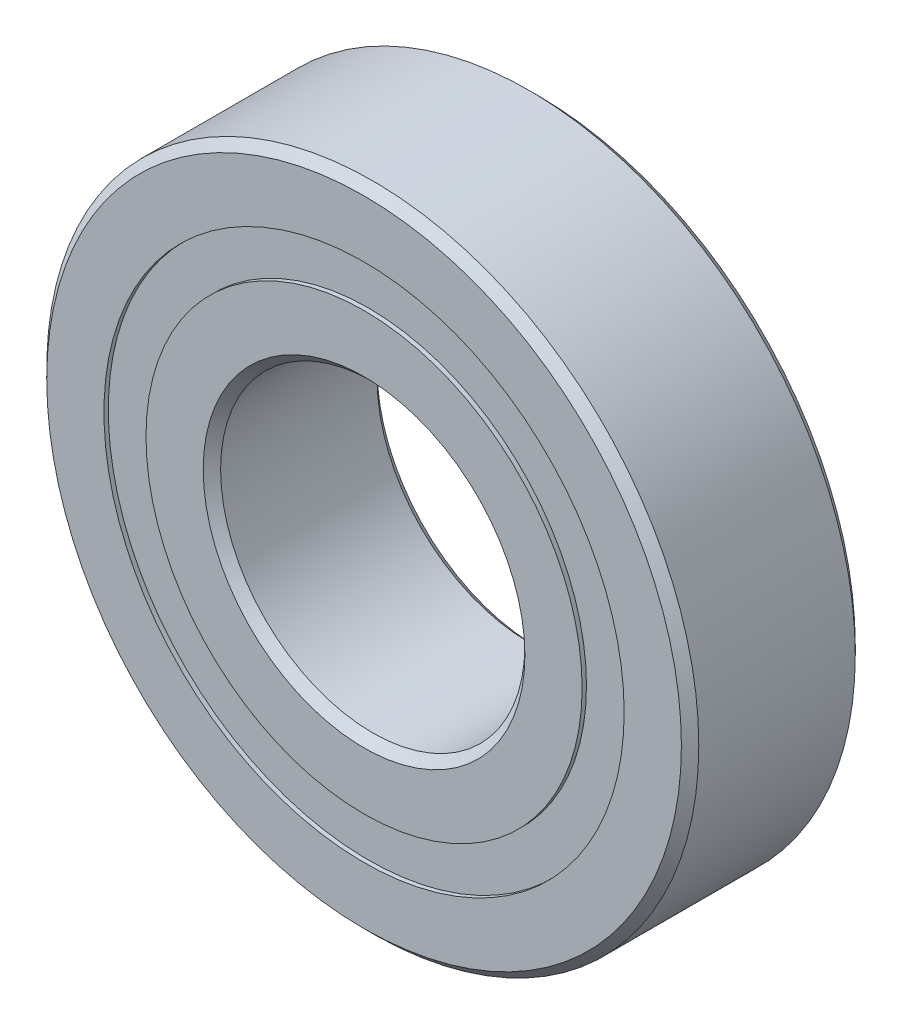
ISO-10303-21;
HEADER;
FILE_DESCRIPTION(('STEP AP214'),'2;1');
FILE_NAME('part.step','',(''),(''),'','','');
FILE_SCHEMA(('AUTOMOTIVE_DESIGN { 1 0 10303 214 1 1 1 1 }'));
ENDSEC;
DATA;
#1=APPLICATION_CONTEXT('core data for automotive mechanical design processes');
#2=APPLICATION_PROTOCOL_DEFINITION('international standard','automotive_design',2000,#1);
#3=PRODUCT_CONTEXT('',#1,'mechanical');
#4=PRODUCT('Part','Part','',(#3));
#5=PRODUCT_RELATED_PRODUCT_CATEGORY('part','',(#4));
#6=PRODUCT_DEFINITION_FORMATION('','',#4);
#7=PRODUCT_DEFINITION_CONTEXT('part definition',#1,'design');
#8=PRODUCT_DEFINITION('design','',#6,#7);
#9=PRODUCT_DEFINITION_SHAPE('','',#8);
#10=(LENGTH_UNIT() NAMED_UNIT(*) SI_UNIT(.MILLI.,.METRE.));
#11=(NAMED_UNIT(*) PLANE_ANGLE_UNIT() SI_UNIT($,.RADIAN.));
#12=(NAMED_UNIT(*) SI_UNIT($,.STERADIAN.) SOLID_ANGLE_UNIT());
#13=UNCERTAINTY_MEASURE_WITH_UNIT(LENGTH_MEASURE(1.E-05),#10,'distance_accuracy_value','');
#14=(GEOMETRIC_REPRESENTATION_CONTEXT(3) GLOBAL_UNCERTAINTY_ASSIGNED_CONTEXT((#13)) GLOBAL_UNIT_ASSIGNED_CONTEXT((#10,
#11,#12)) REPRESENTATION_CONTEXT('',''));
#15=CARTESIAN_POINT('',(0.,0.,0.));
#16=DIRECTION('',(0.,0.,1.));
#17=DIRECTION('',(1.,0.,0.));
#18=AXIS2_PLACEMENT_3D('',#15,#16,#17);
#19=CARTESIAN_POINT('',(0.,18.9976648351648,-6.0325));
#20=DIRECTION('',(0.,0.,1.));
#21=DIRECTION('',(1.,0.,0.));
#22=AXIS2_PLACEMENT_3D('',#19,#20,#21);
#23=PLANE('',#22);
#24=CARTESIAN_POINT('',(0.,0.,-6.0325));
#25=DIRECTION('',(0.,0.,1.));
#26=DIRECTION('',(1.,0.,0.));
#27=AXIS2_PLACEMENT_3D('',#24,#25,#26);
#28=CIRCLE('',#27,18.9976648351648);
#29=CARTESIAN_POINT('',(18.9976648351648,0.,-6.0325));
#30=VERTEX_POINT('',#29);
#31=EDGE_CURVE('E55',#30,#30,#28,.T.);
#32=ORIENTED_EDGE('',*,*,#31,.F.);
#33=EDGE_LOOP('',(#32));
#34=FACE_BOUND('',#33,.T.);
#35=CARTESIAN_POINT('',(0.,0.,-6.0325));
#36=DIRECTION('',(0.,0.,1.));
#37=DIRECTION('',(1.,0.,0.));
#38=AXIS2_PLACEMENT_3D('',#35,#36,#37);
#39=CIRCLE('',#38,15.9273351648352);
#40=CARTESIAN_POINT('',(15.9273351648352,0.,-6.0325));
#41=VERTEX_POINT('',#40);
#42=EDGE_CURVE('E11',#41,#41,#39,.T.);
#43=ORIENTED_EDGE('',*,*,#42,.T.);
#44=EDGE_LOOP('',(#43));
#45=FACE_BOUND('',#44,.T.);
#46=ADVANCED_FACE('F41',(#34,#45),#23,.F.);
#47=CARTESIAN_POINT('',(0.,0.,6.35));
#48=DIRECTION('',(0.,0.,1.));
#49=DIRECTION('',(1.,0.,0.));
#50=AXIS2_PLACEMENT_3D('',#47,#48,#49);
#51=CYLINDRICAL_SURFACE('',#50,15.9273351648352);
#52=ORIENTED_EDGE('',*,*,#42,.F.);
#53=EDGE_LOOP('',(#52));
#54=FACE_BOUND('',#53,.T.);
#55=CARTESIAN_POINT('',(0.,0.,-3.21273549218289));
#56=DIRECTION('',(0.,0.,1.));
#57=DIRECTION('',(1.,0.,0.));
#58=AXIS2_PLACEMENT_3D('',#55,#56,#57);
#59=CIRCLE('',#58,15.9273351648352);
#60=CARTESIAN_POINT('',(15.9273351648352,0.,-3.21273549218289));
#61=VERTEX_POINT('',#60);
#62=EDGE_CURVE('E47',#61,#61,#59,.T.);
#63=ORIENTED_EDGE('',*,*,#62,.T.);
#64=EDGE_LOOP('',(#63));
#65=FACE_BOUND('',#64,.T.);
#66=ADVANCED_FACE('F64',(#54,#65),#51,.F.);
#67=CARTESIAN_POINT('',(0.,18.9976648351648,-3.21273549218289));
#68=DIRECTION('',(0.,0.,-1.));
#69=DIRECTION('',(-1.,0.,0.));
#70=AXIS2_PLACEMENT_3D('',#67,#68,#69);
#71=PLANE('',#70);
#72=ORIENTED_EDGE('',*,*,#62,.F.);
#73=EDGE_LOOP('',(#72));
#74=FACE_BOUND('',#73,.T.);
#75=CARTESIAN_POINT('',(0.,0.,-3.21273549218288));
#76=DIRECTION('',(0.,0.,1.));
#77=DIRECTION('',(1.,0.,0.));
#78=AXIS2_PLACEMENT_3D('',#75,#76,#77);
#79=CIRCLE('',#78,18.9976648351648);
#80=CARTESIAN_POINT('',(18.9976648351648,0.,-3.21273549218288));
#81=VERTEX_POINT('',#80);
#82=EDGE_CURVE('E51',#81,#81,#79,.T.);
#83=ORIENTED_EDGE('',*,*,#82,.T.);
#84=EDGE_LOOP('',(#83));
#85=FACE_BOUND('',#84,.T.);
#86=ADVANCED_FACE('F68',(#74,#85),#71,.F.);
#87=CARTESIAN_POINT('',(0.,0.,6.35));
#88=DIRECTION('',(0.,0.,1.));
#89=DIRECTION('',(1.,0.,0.));
#90=AXIS2_PLACEMENT_3D('',#87,#88,#89);
#91=CYLINDRICAL_SURFACE('',#90,18.9976648351648);
#92=ORIENTED_EDGE('',*,*,#82,.F.);
#93=EDGE_LOOP('',(#92));
#94=FACE_BOUND('',#93,.T.);
#95=ORIENTED_EDGE('',*,*,#31,.T.);
#96=EDGE_LOOP('',(#95));
#97=FACE_BOUND('',#96,.T.);
#98=ADVANCED_FACE('F61',(#94,#97),#91,.T.);
#99=CLOSED_SHELL('',(#46,#66,#86,#98));
#100=MANIFOLD_SOLID_BREP('B2',#99);
#101=CARTESIAN_POINT('',(0.,18.9976648351648,6.0325));
#102=DIRECTION('',(0.,0.,-1.));
#103=DIRECTION('',(-1.,0.,0.));
#104=AXIS2_PLACEMENT_3D('',#101,#102,#103);
#105=PLANE('',#104);
#106=CARTESIAN_POINT('',(0.,0.,6.0325));
#107=DIRECTION('',(0.,0.,1.));
#108=DIRECTION('',(1.,0.,0.));
#109=AXIS2_PLACEMENT_3D('',#106,#107,#108);
#110=CIRCLE('',#109,15.9273351648352);
#111=CARTESIAN_POINT('',(15.9273351648352,0.,6.0325));
#112=VERTEX_POINT('',#111);
#113=EDGE_CURVE('E40',#112,#112,#110,.T.);
#114=ORIENTED_EDGE('',*,*,#113,.F.);
#115=EDGE_LOOP('',(#114));
#116=FACE_BOUND('',#115,.T.);
#117=CARTESIAN_POINT('',(0.,0.,6.0325));
#118=DIRECTION('',(0.,0.,1.));
#119=DIRECTION('',(1.,0.,0.));
#120=AXIS2_PLACEMENT_3D('',#117,#118,#119);
#121=CIRCLE('',#120,18.9976648351648);
#122=CARTESIAN_POINT('',(18.9976648351648,0.,6.0325));
#123=VERTEX_POINT('',#122);
#124=EDGE_CURVE('E122',#123,#123,#121,.T.);
#125=ORIENTED_EDGE('',*,*,#124,.T.);
#126=EDGE_LOOP('',(#125));
#127=FACE_BOUND('',#126,.T.);
#128=ADVANCED_FACE('F108',(#116,#127),#105,.F.);
#129=CARTESIAN_POINT('',(0.,0.,6.35));
#130=DIRECTION('',(0.,0.,1.));
#131=DIRECTION('',(1.,0.,0.));
#132=AXIS2_PLACEMENT_3D('',#129,#130,#131);
#133=CYLINDRICAL_SURFACE('',#132,15.9273351648352);
#134=CARTESIAN_POINT('',(0.,0.,3.21273549218288));
#135=DIRECTION('',(0.,0.,1.));
#136=DIRECTION('',(1.,0.,0.));
#137=AXIS2_PLACEMENT_3D('',#134,#135,#136);
#138=CIRCLE('',#137,15.9273351648352);
#139=CARTESIAN_POINT('',(15.9273351648352,0.,3.21273549218288));
#140=VERTEX_POINT('',#139);
#141=EDGE_CURVE('E114',#140,#140,#138,.T.);
#142=ORIENTED_EDGE('',*,*,#141,.F.);
#143=EDGE_LOOP('',(#142));
#144=FACE_BOUND('',#143,.T.);
#145=ORIENTED_EDGE('',*,*,#113,.T.);
#146=EDGE_LOOP('',(#145));
#147=FACE_BOUND('',#146,.T.);
#148=ADVANCED_FACE('F137',(#144,#147),#133,.F.);
#149=CARTESIAN_POINT('',(0.,18.9976648351648,3.21273549218288));
#150=DIRECTION('',(0.,0.,1.));
#151=DIRECTION('',(1.,0.,0.));
#152=AXIS2_PLACEMENT_3D('',#149,#150,#151);
#153=PLANE('',#152);
#154=CARTESIAN_POINT('',(0.,0.,3.21273549218289));
#155=DIRECTION('',(0.,0.,1.));
#156=DIRECTION('',(1.,0.,0.));
#157=AXIS2_PLACEMENT_3D('',#154,#155,#156);
#158=CIRCLE('',#157,18.9976648351648);
#159=CARTESIAN_POINT('',(18.9976648351648,0.,3.21273549218289));
#160=VERTEX_POINT('',#159);
#161=EDGE_CURVE('E118',#160,#160,#158,.T.);
#162=ORIENTED_EDGE('',*,*,#161,.F.);
#163=EDGE_LOOP('',(#162));
#164=FACE_BOUND('',#163,.T.);
#165=ORIENTED_EDGE('',*,*,#141,.T.);
#166=EDGE_LOOP('',(#165));
#167=FACE_BOUND('',#166,.T.);
#168=ADVANCED_FACE('F132',(#164,#167),#153,.F.);
#169=CARTESIAN_POINT('',(0.,0.,6.35));
#170=DIRECTION('',(0.,0.,1.));
#171=DIRECTION('',(1.,0.,0.));
#172=AXIS2_PLACEMENT_3D('',#169,#170,#171);
#173=CYLINDRICAL_SURFACE('',#172,18.9976648351648);
#174=ORIENTED_EDGE('',*,*,#124,.F.);
#175=EDGE_LOOP('',(#174));
#176=FACE_BOUND('',#175,.T.);
#177=ORIENTED_EDGE('',*,*,#161,.T.);
#178=EDGE_LOOP('',(#177));
#179=FACE_BOUND('',#178,.T.);
#180=ADVANCED_FACE('F129',(#176,#179),#173,.T.);
#181=CLOSED_SHELL('',(#128,#148,#168,#180));
#182=MANIFOLD_SOLID_BREP('B6',#181);
#183=CARTESIAN_POINT('',(-8.73124999999981,15.1229686135859,0.));
#184=DIRECTION('',(0.,0.,1.));
#185=DIRECTION('',(-0.499999999999989,0.866025403784445,0.));
#186=AXIS2_PLACEMENT_3D('',#183,#184,#185);
#187=SPHERICAL_SURFACE('',#186,3.21273549218289);
#188=CARTESIAN_POINT('',(-8.73124999999981,15.1229686135859,3.21273549218288));
#189=VERTEX_POINT('',#188);
#190=VERTEX_LOOP('',#189);
#191=FACE_BOUND('',#190,.T.);
#192=ADVANCED_FACE('F175',(#191),#187,.T.);
#193=CLOSED_SHELL('',(#192));
#194=MANIFOLD_SOLID_BREP('B35',#193);
#195=CARTESIAN_POINT('',(-15.1229686135857,8.73125000000018,0.));
#196=DIRECTION('',(0.,0.,1.));
#197=DIRECTION('',(-0.866025403784433,0.50000000000001,0.));
#198=AXIS2_PLACEMENT_3D('',#195,#196,#197);
#199=SPHERICAL_SURFACE('',#198,3.21273549218289);
#200=CARTESIAN_POINT('',(-15.1229686135857,8.73125000000018,3.21273549218288));
#201=VERTEX_POINT('',#200);
#202=VERTEX_LOOP('',#201);
#203=FACE_BOUND('',#202,.T.);
#204=ADVANCED_FACE('F195',(#203),#199,.T.);
#205=CLOSED_SHELL('',(#204));
#206=MANIFOLD_SOLID_BREP('B104',#205);
#207=CARTESIAN_POINT('',(-17.4625,1.82909978638645E-13,0.));
#208=DIRECTION('',(0.,0.,1.));
#209=DIRECTION('',(-1.,0.,0.));
#210=AXIS2_PLACEMENT_3D('',#207,#208,#209);
#211=SPHERICAL_SURFACE('',#210,3.21273549218289);
#212=CARTESIAN_POINT('',(-17.4625,1.82909978638645E-13,3.21273549218288));
#213=VERTEX_POINT('',#212);
#214=VERTEX_LOOP('',#213);
#215=FACE_BOUND('',#214,.T.);
#216=ADVANCED_FACE('F215',(#215),#211,.T.);
#217=CLOSED_SHELL('',(#216));
#218=MANIFOLD_SOLID_BREP('B171',#217);
#219=CARTESIAN_POINT('',(-15.1229686135858,-8.73124999999986,0.));
#220=DIRECTION('',(0.,0.,1.));
#221=DIRECTION('',(-0.866025403784443,-0.499999999999992,0.));
#222=AXIS2_PLACEMENT_3D('',#219,#220,#221);
#223=SPHERICAL_SURFACE('',#222,3.21273549218289);
#224=CARTESIAN_POINT('',(-15.1229686135858,-8.73124999999986,3.21273549218288));
#225=VERTEX_POINT('',#224);
#226=VERTEX_LOOP('',#225);
#227=FACE_BOUND('',#226,.T.);
#228=ADVANCED_FACE('F235',(#227),#223,.T.);
#229=CLOSED_SHELL('',(#228));
#230=MANIFOLD_SOLID_BREP('B191',#229);
#231=CARTESIAN_POINT('',(-8.73125000000012,-15.1229686135857,0.));
#232=DIRECTION('',(0.,0.,1.));
#233=DIRECTION('',(-0.500000000000007,-0.866025403784435,0.));
#234=AXIS2_PLACEMENT_3D('',#231,#232,#233);
#235=SPHERICAL_SURFACE('',#234,3.21273549218289);
#236=CARTESIAN_POINT('',(-8.73125000000012,-15.1229686135857,3.21273549218288));
#237=VERTEX_POINT('',#236);
#238=VERTEX_LOOP('',#237);
#239=FACE_BOUND('',#238,.T.);
#240=ADVANCED_FACE('F255',(#239),#235,.T.);
#241=CLOSED_SHELL('',(#240));
#242=MANIFOLD_SOLID_BREP('B211',#241);
#243=CARTESIAN_POINT('',(-1.21939985759096E-13,-17.4625,0.));
#244=DIRECTION('',(0.,0.,1.));
#245=DIRECTION('',(0.,-1.,0.));
#246=AXIS2_PLACEMENT_3D('',#243,#244,#245);
#247=SPHERICAL_SURFACE('',#246,3.21273549218289);
#248=CARTESIAN_POINT('',(-1.21939985759096E-13,-17.4625,3.21273549218288));
#249=VERTEX_POINT('',#248);
#250=VERTEX_LOOP('',#249);
#251=FACE_BOUND('',#250,.T.);
#252=ADVANCED_FACE('F275',(#251),#247,.T.);
#253=CLOSED_SHELL('',(#252));
#254=MANIFOLD_SOLID_BREP('B231',#253);
#255=CARTESIAN_POINT('',(8.73124999999991,-15.1229686135858,0.));
#256=DIRECTION('',(0.,0.,1.));
#257=DIRECTION('',(0.499999999999995,-0.866025403784442,0.));
#258=AXIS2_PLACEMENT_3D('',#255,#256,#257);
#259=SPHERICAL_SURFACE('',#258,3.21273549218289);
#260=CARTESIAN_POINT('',(8.73124999999991,-15.1229686135858,3.21273549218288));
#261=VERTEX_POINT('',#260);
#262=VERTEX_LOOP('',#261);
#263=FACE_BOUND('',#262,.T.);
#264=ADVANCED_FACE('F295',(#263),#259,.T.);
#265=CLOSED_SHELL('',(#264));
#266=MANIFOLD_SOLID_BREP('B251',#265);
#267=CARTESIAN_POINT('',(15.1229686135857,-8.73125000000007,0.));
#268=DIRECTION('',(0.,0.,1.));
#269=DIRECTION('',(0.866025403784436,-0.500000000000004,0.));
#270=AXIS2_PLACEMENT_3D('',#267,#268,#269);
#271=SPHERICAL_SURFACE('',#270,3.21273549218289);
#272=CARTESIAN_POINT('',(15.1229686135857,-8.73125000000007,3.21273549218288));
#273=VERTEX_POINT('',#272);
#274=VERTEX_LOOP('',#273);
#275=FACE_BOUND('',#274,.T.);
#276=ADVANCED_FACE('F315',(#275),#271,.T.);
#277=CLOSED_SHELL('',(#276));
#278=MANIFOLD_SOLID_BREP('B271',#277);
#279=CARTESIAN_POINT('',(17.4625,0.,0.));
#280=DIRECTION('',(0.,0.,1.));
#281=DIRECTION('',(1.,0.,0.));
#282=AXIS2_PLACEMENT_3D('',#279,#280,#281);
#283=SPHERICAL_SURFACE('',#282,3.21273549218289);
#284=CARTESIAN_POINT('',(17.4625,0.,3.21273549218288));
#285=VERTEX_POINT('',#284);
#286=VERTEX_LOOP('',#285);
#287=FACE_BOUND('',#286,.T.);
#288=ADVANCED_FACE('F335',(#287),#283,.T.);
#289=CLOSED_SHELL('',(#288));
#290=MANIFOLD_SOLID_BREP('B291',#289);
#291=CARTESIAN_POINT('',(15.1229686135858,8.73124999999997,0.));
#292=DIRECTION('',(0.,0.,1.));
#293=DIRECTION('',(0.86602540378444,0.499999999999998,0.));
#294=AXIS2_PLACEMENT_3D('',#291,#292,#293);
#295=SPHERICAL_SURFACE('',#294,3.21273549218289);
#296=CARTESIAN_POINT('',(15.1229686135858,8.73124999999997,3.21273549218288));
#297=VERTEX_POINT('',#296);
#298=VERTEX_LOOP('',#297);
#299=FACE_BOUND('',#298,.T.);
#300=ADVANCED_FACE('F355',(#299),#295,.T.);
#301=CLOSED_SHELL('',(#300));
#302=MANIFOLD_SOLID_BREP('B311',#301);
#303=CARTESIAN_POINT('',(8.73125000000002,15.1229686135857,0.));
#304=DIRECTION('',(0.,0.,1.));
#305=DIRECTION('',(0.500000000000001,0.866025403784438,0.));
#306=AXIS2_PLACEMENT_3D('',#303,#304,#305);
#307=SPHERICAL_SURFACE('',#306,3.21273549218289);
#308=CARTESIAN_POINT('',(8.73125000000002,15.1229686135857,3.21273549218288));
#309=VERTEX_POINT('',#308);
#310=VERTEX_LOOP('',#309);
#311=FACE_BOUND('',#310,.T.);
#312=ADVANCED_FACE('F375',(#311),#307,.T.);
#313=CLOSED_SHELL('',(#312));
#314=MANIFOLD_SOLID_BREP('B331',#313);
#315=CARTESIAN_POINT('',(0.,17.4625,0.));
#316=DIRECTION('',(0.,0.,1.));
#317=DIRECTION('',(0.,1.,0.));
#318=AXIS2_PLACEMENT_3D('',#315,#316,#317);
#319=SPHERICAL_SURFACE('',#318,3.21273549218289);
#320=CARTESIAN_POINT('',(0.,17.4625,3.21273549218288));
#321=VERTEX_POINT('',#320);
#322=VERTEX_LOOP('',#321);
#323=FACE_BOUND('',#322,.T.);
#324=ADVANCED_FACE('F397',(#323),#319,.T.);
#325=CLOSED_SHELL('',(#324));
#326=MANIFOLD_SOLID_BREP('B351',#325);
#327=CARTESIAN_POINT('',(0.,15.9273351648352,6.35));
#328=DIRECTION('',(0.,0.,-1.));
#329=DIRECTION('',(-1.,0.,0.));
#330=AXIS2_PLACEMENT_3D('',#327,#328,#329);
#331=PLANE('',#330);
#332=CARTESIAN_POINT('',(0.,0.,6.35));
#333=DIRECTION('',(0.,0.,1.));
#334=DIRECTION('',(1.,0.,0.));
#335=AXIS2_PLACEMENT_3D('',#332,#333,#334);
#336=CIRCLE('',#335,11.7475);
#337=CARTESIAN_POINT('',(11.7475,0.,6.35));
#338=VERTEX_POINT('',#337);
#339=EDGE_CURVE('E444',#338,#338,#336,.T.);
#340=ORIENTED_EDGE('',*,*,#339,.F.);
#341=EDGE_LOOP('',(#340));
#342=FACE_BOUND('',#341,.T.);
#343=CARTESIAN_POINT('',(0.,0.,6.35));
#344=DIRECTION('',(0.,0.,1.));
#345=DIRECTION('',(1.,0.,0.));
#346=AXIS2_PLACEMENT_3D('',#343,#344,#345);
#347=CIRCLE('',#346,15.9273351648352);
#348=CARTESIAN_POINT('',(15.9273351648352,0.,6.35));
#349=VERTEX_POINT('',#348);
#350=EDGE_CURVE('E396',#349,#349,#347,.T.);
#351=ORIENTED_EDGE('',*,*,#350,.T.);
#352=EDGE_LOOP('',(#351));
#353=FACE_BOUND('',#352,.T.);
#354=ADVANCED_FACE('F416',(#342,#353),#331,.F.);
#355=CARTESIAN_POINT('',(0.,0.,6.35));
#356=DIRECTION('',(0.,0.,1.));
#357=DIRECTION('',(1.,0.,0.));
#358=AXIS2_PLACEMENT_3D('',#355,#356,#357);
#359=CYLINDRICAL_SURFACE('',#358,15.9273351648352);
#360=ORIENTED_EDGE('',*,*,#350,.F.);
#361=EDGE_LOOP('',(#360));
#362=FACE_BOUND('',#361,.T.);
#363=CARTESIAN_POINT('',(0.,0.,2.82222222222222));
#364=DIRECTION('',(0.,0.,1.));
#365=DIRECTION('',(1.,0.,0.));
#366=AXIS2_PLACEMENT_3D('',#363,#364,#365);
#367=CIRCLE('',#366,15.9273351648352);
#368=CARTESIAN_POINT('',(15.9273351648352,0.,2.82222222222222));
#369=VERTEX_POINT('',#368);
#370=EDGE_CURVE('E422',#369,#369,#367,.T.);
#371=ORIENTED_EDGE('',*,*,#370,.T.);
#372=EDGE_LOOP('',(#371));
#373=FACE_BOUND('',#372,.T.);
#374=ADVANCED_FACE('F451',(#362,#373),#359,.T.);
#375=CARTESIAN_POINT('',(0.,0.,0.));
#376=DIRECTION('',(0.,0.,1.));
#377=DIRECTION('',(1.,0.,0.));
#378=AXIS2_PLACEMENT_3D('',#375,#376,#377);
#379=TOROIDAL_SURFACE('',#378,17.4625,3.21273549218288);
#380=ORIENTED_EDGE('',*,*,#370,.F.);
#381=EDGE_LOOP('',(#380));
#382=FACE_BOUND('',#381,.T.);
#383=CARTESIAN_POINT('',(0.,0.,-2.82222222222223));
#384=DIRECTION('',(0.,0.,1.));
#385=DIRECTION('',(1.,0.,0.));
#386=AXIS2_PLACEMENT_3D('',#383,#384,#385);
#387=CIRCLE('',#386,15.9273351648352);
#388=CARTESIAN_POINT('',(15.9273351648352,0.,-2.82222222222223));
#389=VERTEX_POINT('',#388);
#390=EDGE_CURVE('E426',#389,#389,#387,.T.);
#391=ORIENTED_EDGE('',*,*,#390,.T.);
#392=EDGE_LOOP('',(#391));
#393=FACE_BOUND('',#392,.T.);
#394=ADVANCED_FACE('F455',(#382,#393),#379,.F.);
#395=CARTESIAN_POINT('',(0.,0.,6.35));
#396=DIRECTION('',(0.,0.,1.));
#397=DIRECTION('',(1.,0.,0.));
#398=AXIS2_PLACEMENT_3D('',#395,#396,#397);
#399=CYLINDRICAL_SURFACE('',#398,15.9273351648352);
#400=ORIENTED_EDGE('',*,*,#390,.F.);
#401=EDGE_LOOP('',(#400));
#402=FACE_BOUND('',#401,.T.);
#403=CARTESIAN_POINT('',(0.,0.,-6.35));
#404=DIRECTION('',(0.,0.,1.));
#405=DIRECTION('',(1.,0.,0.));
#406=AXIS2_PLACEMENT_3D('',#403,#404,#405);
#407=CIRCLE('',#406,15.9273351648352);
#408=CARTESIAN_POINT('',(15.9273351648352,0.,-6.35));
#409=VERTEX_POINT('',#408);
#410=EDGE_CURVE('E430',#409,#409,#407,.T.);
#411=ORIENTED_EDGE('',*,*,#410,.T.);
#412=EDGE_LOOP('',(#411));
#413=FACE_BOUND('',#412,.T.);
#414=ADVANCED_FACE('F460',(#402,#413),#399,.T.);
#415=CARTESIAN_POINT('',(0.,11.7475,-6.35));
#416=DIRECTION('',(0.,0.,1.));
#417=DIRECTION('',(1.,0.,0.));
#418=AXIS2_PLACEMENT_3D('',#415,#416,#417);
#419=PLANE('',#418);
#420=ORIENTED_EDGE('',*,*,#410,.F.);
#421=EDGE_LOOP('',(#420));
#422=FACE_BOUND('',#421,.T.);
#423=CARTESIAN_POINT('',(0.,0.,-6.35));
#424=DIRECTION('',(0.,0.,1.));
#425=DIRECTION('',(1.,0.,0.));
#426=AXIS2_PLACEMENT_3D('',#423,#424,#425);
#427=CIRCLE('',#426,11.7475);
#428=CARTESIAN_POINT('',(11.7475,0.,-6.35));
#429=VERTEX_POINT('',#428);
#430=EDGE_CURVE('E435',#429,#429,#427,.T.);
#431=ORIENTED_EDGE('',*,*,#430,.T.);
#432=EDGE_LOOP('',(#431));
#433=FACE_BOUND('',#432,.T.);
#434=ADVANCED_FACE('F466',(#422,#433),#419,.F.);
#435=CARTESIAN_POINT('',(0.,0.,-5.715));
#436=DIRECTION('',(0.,0.,-1.));
#437=DIRECTION('',(-1.,0.,0.));
#438=AXIS2_PLACEMENT_3D('',#435,#436,#437);
#439=CONICAL_SURFACE('',#438,11.1125,0.785398163397446);
#440=ORIENTED_EDGE('',*,*,#430,.F.);
#441=EDGE_LOOP('',(#440));
#442=FACE_BOUND('',#441,.T.);
#443=CARTESIAN_POINT('',(0.,0.,-5.715));
#444=DIRECTION('',(0.,0.,1.));
#445=DIRECTION('',(1.,0.,0.));
#446=AXIS2_PLACEMENT_3D('',#443,#444,#445);
#447=CIRCLE('',#446,11.1125);
#448=CARTESIAN_POINT('',(11.1125,0.,-5.715));
#449=VERTEX_POINT('',#448);
#450=EDGE_CURVE('E438',#449,#449,#447,.T.);
#451=ORIENTED_EDGE('',*,*,#450,.T.);
#452=EDGE_LOOP('',(#451));
#453=FACE_BOUND('',#452,.T.);
#454=ADVANCED_FACE('F470',(#442,#453),#439,.F.);
#455=CARTESIAN_POINT('',(0.,0.,6.35));
#456=DIRECTION('',(0.,0.,1.));
#457=DIRECTION('',(1.,0.,0.));
#458=AXIS2_PLACEMENT_3D('',#455,#456,#457);
#459=CYLINDRICAL_SURFACE('',#458,11.1125);
#460=ORIENTED_EDGE('',*,*,#450,.F.);
#461=EDGE_LOOP('',(#460));
#462=FACE_BOUND('',#461,.T.);
#463=CARTESIAN_POINT('',(0.,0.,5.71500000000001));
#464=DIRECTION('',(0.,0.,1.));
#465=DIRECTION('',(1.,0.,0.));
#466=AXIS2_PLACEMENT_3D('',#463,#464,#465);
#467=CIRCLE('',#466,11.1125);
#468=CARTESIAN_POINT('',(11.1125,0.,5.71500000000001));
#469=VERTEX_POINT('',#468);
#470=EDGE_CURVE('E441',#469,#469,#467,.T.);
#471=ORIENTED_EDGE('',*,*,#470,.T.);
#472=EDGE_LOOP('',(#471));
#473=FACE_BOUND('',#472,.T.);
#474=ADVANCED_FACE('F474',(#462,#473),#459,.F.);
#475=CARTESIAN_POINT('',(0.,0.,6.35));
#476=DIRECTION('',(0.,0.,1.));
#477=DIRECTION('',(1.,0.,0.));
#478=AXIS2_PLACEMENT_3D('',#475,#476,#477);
#479=CONICAL_SURFACE('',#478,11.7475,0.785398163397452);
#480=ORIENTED_EDGE('',*,*,#470,.F.);
#481=EDGE_LOOP('',(#480));
#482=FACE_BOUND('',#481,.T.);
#483=ORIENTED_EDGE('',*,*,#339,.T.);
#484=EDGE_LOOP('',(#483));
#485=FACE_BOUND('',#484,.T.);
#486=ADVANCED_FACE('F448',(#482,#485),#479,.F.);
#487=CLOSED_SHELL('',(#354,#374,#394,#414,#434,#454,#474,#486));
#488=MANIFOLD_SOLID_BREP('B371',#487);
#489=CARTESIAN_POINT('',(0.,0.,5.715));
#490=DIRECTION('',(0.,0.,-1.));
#491=DIRECTION('',(-1.,0.,0.));
#492=AXIS2_PLACEMENT_3D('',#489,#490,#491);
#493=CONICAL_SURFACE('',#492,23.8125,0.785398163397446);
#494=CARTESIAN_POINT('',(0.,0.,6.35));
#495=DIRECTION('',(0.,0.,1.));
#496=DIRECTION('',(1.,0.,0.));
#497=AXIS2_PLACEMENT_3D('',#494,#495,#496);
#498=CIRCLE('',#497,23.1775);
#499=CARTESIAN_POINT('',(23.1775,0.,6.35));
#500=VERTEX_POINT('',#499);
#501=EDGE_CURVE('E565',#500,#500,#498,.T.);
#502=ORIENTED_EDGE('',*,*,#501,.F.);
#503=EDGE_LOOP('',(#502));
#504=FACE_BOUND('',#503,.T.);
#505=CARTESIAN_POINT('',(0.,0.,5.715));
#506=DIRECTION('',(0.,0.,1.));
#507=DIRECTION('',(1.,0.,0.));
#508=AXIS2_PLACEMENT_3D('',#505,#506,#507);
#509=CIRCLE('',#508,23.8125);
#510=CARTESIAN_POINT('',(23.8125,0.,5.715));
#511=VERTEX_POINT('',#510);
#512=EDGE_CURVE('E415',#511,#511,#509,.T.);
#513=ORIENTED_EDGE('',*,*,#512,.T.);
#514=EDGE_LOOP('',(#513));
#515=FACE_BOUND('',#514,.T.);
#516=ADVANCED_FACE('F537',(#504,#515),#493,.T.);
#517=CARTESIAN_POINT('',(0.,0.,6.35));
#518=DIRECTION('',(0.,0.,1.));
#519=DIRECTION('',(1.,0.,0.));
#520=AXIS2_PLACEMENT_3D('',#517,#518,#519);
#521=CYLINDRICAL_SURFACE('',#520,23.8125);
#522=ORIENTED_EDGE('',*,*,#512,.F.);
#523=EDGE_LOOP('',(#522));
#524=FACE_BOUND('',#523,.T.);
#525=CARTESIAN_POINT('',(0.,0.,-5.715));
#526=DIRECTION('',(0.,0.,1.));
#527=DIRECTION('',(1.,0.,0.));
#528=AXIS2_PLACEMENT_3D('',#525,#526,#527);
#529=CIRCLE('',#528,23.8125);
#530=CARTESIAN_POINT('',(23.8125,0.,-5.715));
#531=VERTEX_POINT('',#530);
#532=EDGE_CURVE('E543',#531,#531,#529,.T.);
#533=ORIENTED_EDGE('',*,*,#532,.T.);
#534=EDGE_LOOP('',(#533));
#535=FACE_BOUND('',#534,.T.);
#536=ADVANCED_FACE('F572',(#524,#535),#521,.T.);
#537=CARTESIAN_POINT('',(0.,0.,-6.35));
#538=DIRECTION('',(0.,0.,1.));
#539=DIRECTION('',(1.,0.,0.));
#540=AXIS2_PLACEMENT_3D('',#537,#538,#539);
#541=CONICAL_SURFACE('',#540,23.1775,0.785398163397446);
#542=ORIENTED_EDGE('',*,*,#532,.F.);
#543=EDGE_LOOP('',(#542));
#544=FACE_BOUND('',#543,.T.);
#545=CARTESIAN_POINT('',(0.,0.,-6.35));
#546=DIRECTION('',(0.,0.,1.));
#547=DIRECTION('',(1.,0.,0.));
#548=AXIS2_PLACEMENT_3D('',#545,#546,#547);
#549=CIRCLE('',#548,23.1775);
#550=CARTESIAN_POINT('',(23.1775,0.,-6.35));
#551=VERTEX_POINT('',#550);
#552=EDGE_CURVE('E547',#551,#551,#549,.T.);
#553=ORIENTED_EDGE('',*,*,#552,.T.);
#554=EDGE_LOOP('',(#553));
#555=FACE_BOUND('',#554,.T.);
#556=ADVANCED_FACE('F576',(#544,#555),#541,.T.);
#557=CARTESIAN_POINT('',(0.,23.1775,-6.35));
#558=DIRECTION('',(0.,0.,1.));
#559=DIRECTION('',(1.,0.,0.));
#560=AXIS2_PLACEMENT_3D('',#557,#558,#559);
#561=PLANE('',#560);
#562=ORIENTED_EDGE('',*,*,#552,.F.);
#563=EDGE_LOOP('',(#562));
#564=FACE_BOUND('',#563,.T.);
#565=CARTESIAN_POINT('',(0.,0.,-6.35));
#566=DIRECTION('',(0.,0.,1.));
#567=DIRECTION('',(1.,0.,0.));
#568=AXIS2_PLACEMENT_3D('',#565,#566,#567);
#569=CIRCLE('',#568,18.9976648351648);
#570=CARTESIAN_POINT('',(18.9976648351648,0.,-6.35));
#571=VERTEX_POINT('',#570);
#572=EDGE_CURVE('E551',#571,#571,#569,.T.);
#573=ORIENTED_EDGE('',*,*,#572,.T.);
#574=EDGE_LOOP('',(#573));
#575=FACE_BOUND('',#574,.T.);
#576=ADVANCED_FACE('F581',(#564,#575),#561,.F.);
#577=CARTESIAN_POINT('',(0.,0.,6.35));
#578=DIRECTION('',(0.,0.,1.));
#579=DIRECTION('',(1.,0.,0.));
#580=AXIS2_PLACEMENT_3D('',#577,#578,#579);
#581=CYLINDRICAL_SURFACE('',#580,18.9976648351648);
#582=ORIENTED_EDGE('',*,*,#572,.F.);
#583=EDGE_LOOP('',(#582));
#584=FACE_BOUND('',#583,.T.);
#585=CARTESIAN_POINT('',(0.,0.,-2.82222222222222));
#586=DIRECTION('',(0.,0.,1.));
#587=DIRECTION('',(1.,0.,0.));
#588=AXIS2_PLACEMENT_3D('',#585,#586,#587);
#589=CIRCLE('',#588,18.9976648351648);
#590=CARTESIAN_POINT('',(18.9976648351648,0.,-2.82222222222222));
#591=VERTEX_POINT('',#590);
#592=EDGE_CURVE('E556',#591,#591,#589,.T.);
#593=ORIENTED_EDGE('',*,*,#592,.T.);
#594=EDGE_LOOP('',(#593));
#595=FACE_BOUND('',#594,.T.);
#596=ADVANCED_FACE('F587',(#584,#595),#581,.F.);
#597=CARTESIAN_POINT('',(0.,0.,0.));
#598=DIRECTION('',(0.,0.,1.));
#599=DIRECTION('',(1.,0.,0.));
#600=AXIS2_PLACEMENT_3D('',#597,#598,#599);
#601=TOROIDAL_SURFACE('',#600,17.4625,3.21273549218288);
#602=ORIENTED_EDGE('',*,*,#592,.F.);
#603=EDGE_LOOP('',(#602));
#604=FACE_BOUND('',#603,.T.);
#605=CARTESIAN_POINT('',(0.,0.,2.82222222222222));
#606=DIRECTION('',(0.,0.,1.));
#607=DIRECTION('',(1.,0.,0.));
#608=AXIS2_PLACEMENT_3D('',#605,#606,#607);
#609=CIRCLE('',#608,18.9976648351648);
#610=CARTESIAN_POINT('',(18.9976648351648,0.,2.82222222222222));
#611=VERTEX_POINT('',#610);
#612=EDGE_CURVE('E559',#611,#611,#609,.T.);
#613=ORIENTED_EDGE('',*,*,#612,.T.);
#614=EDGE_LOOP('',(#613));
#615=FACE_BOUND('',#614,.T.);
#616=ADVANCED_FACE('F591',(#604,#615),#601,.F.);
#617=CARTESIAN_POINT('',(0.,0.,6.35));
#618=DIRECTION('',(0.,0.,1.));
#619=DIRECTION('',(1.,0.,0.));
#620=AXIS2_PLACEMENT_3D('',#617,#618,#619);
#621=CYLINDRICAL_SURFACE('',#620,18.9976648351648);
#622=ORIENTED_EDGE('',*,*,#612,.F.);
#623=EDGE_LOOP('',(#622));
#624=FACE_BOUND('',#623,.T.);
#625=CARTESIAN_POINT('',(0.,0.,6.35));
#626=DIRECTION('',(0.,0.,1.));
#627=DIRECTION('',(1.,0.,0.));
#628=AXIS2_PLACEMENT_3D('',#625,#626,#627);
#629=CIRCLE('',#628,18.9976648351648);
#630=CARTESIAN_POINT('',(18.9976648351648,0.,6.35));
#631=VERTEX_POINT('',#630);
#632=EDGE_CURVE('E562',#631,#631,#629,.T.);
#633=ORIENTED_EDGE('',*,*,#632,.T.);
#634=EDGE_LOOP('',(#633));
#635=FACE_BOUND('',#634,.T.);
#636=ADVANCED_FACE('F595',(#624,#635),#621,.F.);
#637=CARTESIAN_POINT('',(0.,23.1775,6.35));
#638=DIRECTION('',(0.,0.,-1.));
#639=DIRECTION('',(-1.,0.,0.));
#640=AXIS2_PLACEMENT_3D('',#637,#638,#639);
#641=PLANE('',#640);
#642=ORIENTED_EDGE('',*,*,#632,.F.);
#643=EDGE_LOOP('',(#642));
#644=FACE_BOUND('',#643,.T.);
#645=ORIENTED_EDGE('',*,*,#501,.T.);
#646=EDGE_LOOP('',(#645));
#647=FACE_BOUND('',#646,.T.);
#648=ADVANCED_FACE('F569',(#644,#647),#641,.F.);
#649=CLOSED_SHELL('',(#516,#536,#556,#576,#596,#616,#636,#648));
#650=MANIFOLD_SOLID_BREP('B391',#649);
#651=ADVANCED_BREP_SHAPE_REPRESENTATION('',(#18,#100,#182,#194,#206,#218,#230,#242,#254,#266,
#278,#290,#302,#314,#326,#488,#650),#14);
#652=SHAPE_DEFINITION_REPRESENTATION(#9,#651);
ENDSEC;
END-ISO-10303-21;
